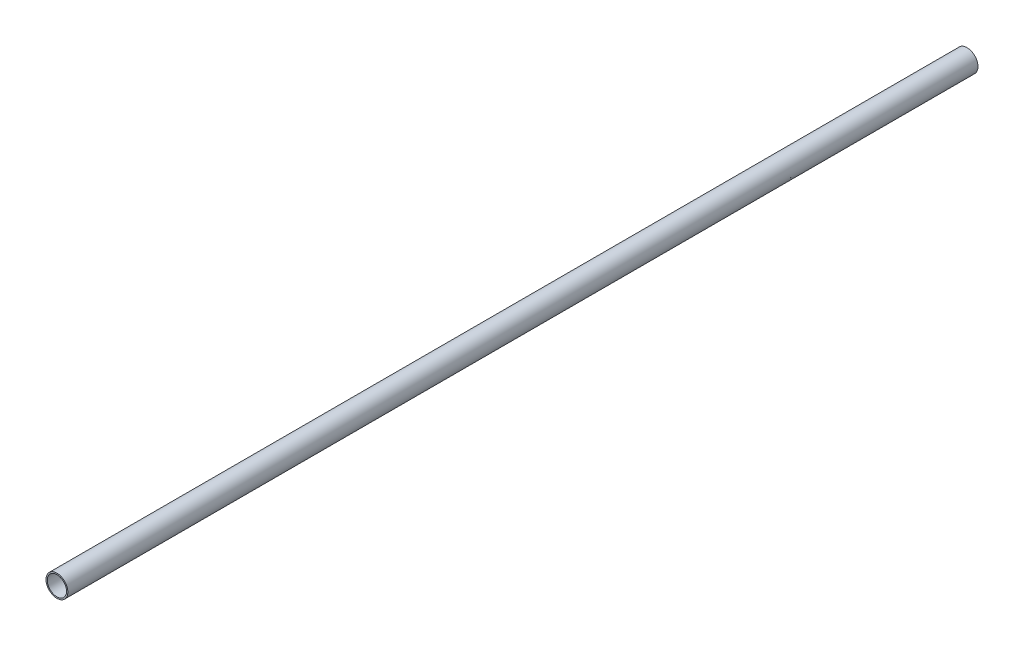
ISO-10303-21;
HEADER;
FILE_DESCRIPTION(('STEP AP214'),'2;1');
FILE_NAME('part.step','',(''),(''),'','','');
FILE_SCHEMA(('AUTOMOTIVE_DESIGN { 1 0 10303 214 1 1 1 1 }'));
ENDSEC;
DATA;
#1=APPLICATION_CONTEXT('core data for automotive mechanical design processes');
#2=APPLICATION_PROTOCOL_DEFINITION('international standard','automotive_design',2000,#1);
#3=PRODUCT_CONTEXT('',#1,'mechanical');
#4=PRODUCT('Part','Part','',(#3));
#5=PRODUCT_RELATED_PRODUCT_CATEGORY('part','',(#4));
#6=PRODUCT_DEFINITION_FORMATION('','',#4);
#7=PRODUCT_DEFINITION_CONTEXT('part definition',#1,'design');
#8=PRODUCT_DEFINITION('design','',#6,#7);
#9=PRODUCT_DEFINITION_SHAPE('','',#8);
#10=(LENGTH_UNIT() NAMED_UNIT(*) SI_UNIT(.MILLI.,.METRE.));
#11=(NAMED_UNIT(*) PLANE_ANGLE_UNIT() SI_UNIT($,.RADIAN.));
#12=(NAMED_UNIT(*) SI_UNIT($,.STERADIAN.) SOLID_ANGLE_UNIT());
#13=UNCERTAINTY_MEASURE_WITH_UNIT(LENGTH_MEASURE(1.E-05),#10,'distance_accuracy_value','');
#14=(GEOMETRIC_REPRESENTATION_CONTEXT(3) GLOBAL_UNCERTAINTY_ASSIGNED_CONTEXT((#13)) GLOBAL_UNIT_ASSIGNED_CONTEXT((#10,
#11,#12)) REPRESENTATION_CONTEXT('',''));
#15=CARTESIAN_POINT('',(0.,0.,0.));
#16=DIRECTION('',(0.,0.,1.));
#17=DIRECTION('',(1.,0.,0.));
#18=AXIS2_PLACEMENT_3D('',#15,#16,#17);
#19=CARTESIAN_POINT('',(0.,1269.,-3240.));
#20=DIRECTION('',(0.,0.,1.));
#21=DIRECTION('',(1.,0.,0.));
#22=AXIS2_PLACEMENT_3D('',#19,#20,#21);
#23=CYLINDRICAL_SURFACE('',#22,12.5);
#24=CARTESIAN_POINT('',(0.,1269.,-1060.));
#25=DIRECTION('',(0.,0.,-1.));
#26=DIRECTION('',(-1.,0.,0.));
#27=AXIS2_PLACEMENT_3D('',#24,#25,#26);
#28=CIRCLE('',#27,12.5);
#29=CARTESIAN_POINT('',(-12.5,1269.,-1060.));
#30=VERTEX_POINT('',#29);
#31=EDGE_CURVE('E51',#30,#30,#28,.T.);
#32=ORIENTED_EDGE('',*,*,#31,.F.);
#33=EDGE_LOOP('',(#32));
#34=FACE_BOUND('',#33,.T.);
#35=CARTESIAN_POINT('',(0.,1269.,-19.9999999999996));
#36=DIRECTION('',(0.,0.,1.));
#37=DIRECTION('',(1.,0.,0.));
#38=AXIS2_PLACEMENT_3D('',#35,#36,#37);
#39=CIRCLE('',#38,12.5);
#40=CARTESIAN_POINT('',(12.5,1269.,-19.9999999999996));
#41=VERTEX_POINT('',#40);
#42=EDGE_CURVE('E41',#41,#41,#39,.T.);
#43=ORIENTED_EDGE('',*,*,#42,.F.);
#44=EDGE_LOOP('',(#43));
#45=FACE_BOUND('',#44,.T.);
#46=ADVANCED_FACE('F37',(#34,#45),#23,.T.);
#47=CARTESIAN_POINT('',(-15.5,0.,-1060.));
#48=DIRECTION('',(0.,0.,-1.));
#49=DIRECTION('',(-1.,0.,0.));
#50=AXIS2_PLACEMENT_3D('',#47,#48,#49);
#51=PLANE('',#50);
#52=CARTESIAN_POINT('',(0.,1269.,-1060.));
#53=DIRECTION('',(0.,0.,-1.));
#54=DIRECTION('',(-1.,0.,0.));
#55=AXIS2_PLACEMENT_3D('',#52,#53,#54);
#56=CIRCLE('',#55,11.);
#57=CARTESIAN_POINT('',(-11.,1269.,-1060.));
#58=VERTEX_POINT('',#57);
#59=EDGE_CURVE('E49',#58,#58,#56,.T.);
#60=ORIENTED_EDGE('',*,*,#59,.F.);
#61=EDGE_LOOP('',(#60));
#62=FACE_BOUND('',#61,.T.);
#63=ORIENTED_EDGE('',*,*,#31,.T.);
#64=EDGE_LOOP('',(#63));
#65=FACE_BOUND('',#64,.T.);
#66=ADVANCED_FACE('F59',(#62,#65),#51,.T.);
#67=CARTESIAN_POINT('',(-15.5,-2.22044604925031E-13,-19.9999999999998));
#68=DIRECTION('',(0.,0.,1.));
#69=DIRECTION('',(1.,0.,0.));
#70=AXIS2_PLACEMENT_3D('',#67,#68,#69);
#71=PLANE('',#70);
#72=CARTESIAN_POINT('',(0.,1269.,-19.9999999999996));
#73=DIRECTION('',(0.,0.,1.));
#74=DIRECTION('',(1.,0.,0.));
#75=AXIS2_PLACEMENT_3D('',#72,#73,#74);
#76=CIRCLE('',#75,11.);
#77=CARTESIAN_POINT('',(11.,1269.,-19.9999999999996));
#78=VERTEX_POINT('',#77);
#79=EDGE_CURVE('E10',#78,#78,#76,.T.);
#80=ORIENTED_EDGE('',*,*,#79,.F.);
#81=EDGE_LOOP('',(#80));
#82=FACE_BOUND('',#81,.T.);
#83=ORIENTED_EDGE('',*,*,#42,.T.);
#84=EDGE_LOOP('',(#83));
#85=FACE_BOUND('',#84,.T.);
#86=ADVANCED_FACE('F61',(#82,#85),#71,.T.);
#87=CARTESIAN_POINT('',(0.,1269.,-3240.));
#88=DIRECTION('',(0.,0.,1.));
#89=DIRECTION('',(1.,0.,0.));
#90=AXIS2_PLACEMENT_3D('',#87,#88,#89);
#91=CYLINDRICAL_SURFACE('',#90,11.);
#92=ORIENTED_EDGE('',*,*,#59,.T.);
#93=EDGE_LOOP('',(#92));
#94=FACE_BOUND('',#93,.T.);
#95=ORIENTED_EDGE('',*,*,#79,.T.);
#96=EDGE_LOOP('',(#95));
#97=FACE_BOUND('',#96,.T.);
#98=ADVANCED_FACE('F39',(#94,#97),#91,.F.);
#99=CLOSED_SHELL('',(#46,#66,#86,#98));
#100=MANIFOLD_SOLID_BREP('B2',#99);
#101=ADVANCED_BREP_SHAPE_REPRESENTATION('',(#18,#100),#14);
#102=SHAPE_DEFINITION_REPRESENTATION(#9,#101);
ENDSEC;
END-ISO-10303-21;
